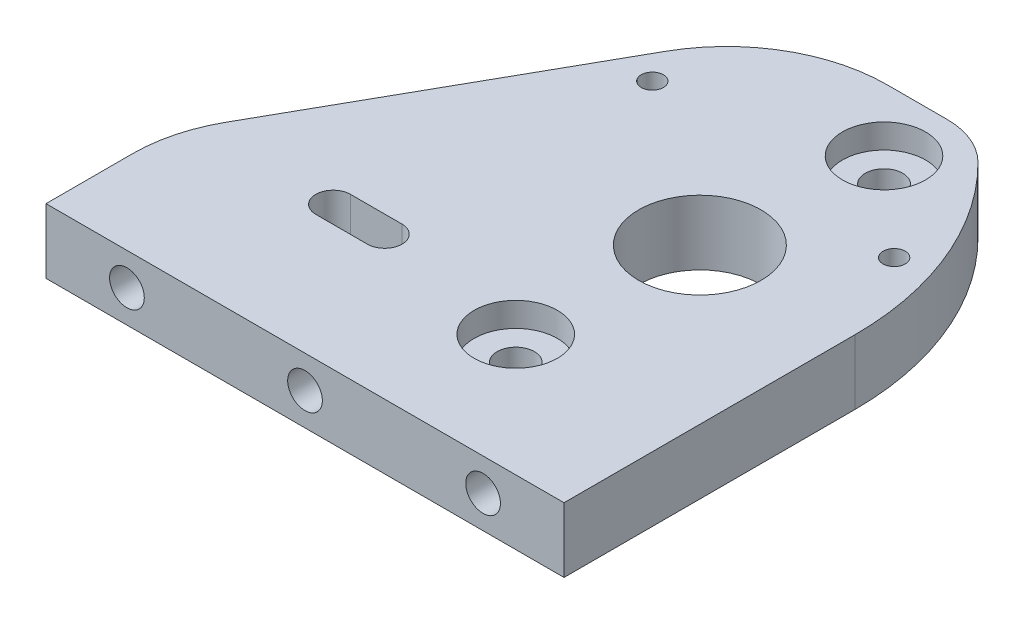
ISO-10303-21;
HEADER;
FILE_DESCRIPTION(('STEP AP214'),'2;1');
FILE_NAME('part.step','',(''),(''),'','','');
FILE_SCHEMA(('AUTOMOTIVE_DESIGN { 1 0 10303 214 1 1 1 1 }'));
ENDSEC;
DATA;
#1=APPLICATION_CONTEXT('core data for automotive mechanical design processes');
#2=APPLICATION_PROTOCOL_DEFINITION('international standard','automotive_design',2000,#1);
#3=PRODUCT_CONTEXT('',#1,'mechanical');
#4=PRODUCT('Part','Part','',(#3));
#5=PRODUCT_RELATED_PRODUCT_CATEGORY('part','',(#4));
#6=PRODUCT_DEFINITION_FORMATION('','',#4);
#7=PRODUCT_DEFINITION_CONTEXT('part definition',#1,'design');
#8=PRODUCT_DEFINITION('design','',#6,#7);
#9=PRODUCT_DEFINITION_SHAPE('','',#8);
#10=(LENGTH_UNIT() NAMED_UNIT(*) SI_UNIT(.MILLI.,.METRE.));
#11=(NAMED_UNIT(*) PLANE_ANGLE_UNIT() SI_UNIT($,.RADIAN.));
#12=(NAMED_UNIT(*) SI_UNIT($,.STERADIAN.) SOLID_ANGLE_UNIT());
#13=UNCERTAINTY_MEASURE_WITH_UNIT(LENGTH_MEASURE(1.E-05),#10,'distance_accuracy_value','');
#14=(GEOMETRIC_REPRESENTATION_CONTEXT(3) GLOBAL_UNCERTAINTY_ASSIGNED_CONTEXT((#13)) GLOBAL_UNIT_ASSIGNED_CONTEXT((#10,
#11,#12)) REPRESENTATION_CONTEXT('',''));
#15=CARTESIAN_POINT('',(0.,0.,0.));
#16=DIRECTION('',(0.,0.,1.));
#17=DIRECTION('',(1.,0.,0.));
#18=AXIS2_PLACEMENT_3D('',#15,#16,#17);
#19=CARTESIAN_POINT('',(0.,9.525,0.));
#20=DIRECTION('',(0.,-1.,0.));
#21=DIRECTION('',(0.,0.,-1.));
#22=AXIS2_PLACEMENT_3D('',#19,#20,#21);
#23=PLANE('',#22);
#24=DIRECTION('',(1.,0.,0.));
#25=VECTOR('',#24,1.);
#26=CARTESIAN_POINT('',(18.030825,9.525,-23.5800563674416));
#27=LINE('',#26,#25);
#28=CARTESIAN_POINT('',(18.030825,9.525,-23.5800563674416));
#29=VERTEX_POINT('',#28);
#30=CARTESIAN_POINT('',(25.625425,9.525,-23.5800563674416));
#31=VERTEX_POINT('',#30);
#32=EDGE_CURVE('E292',#29,#31,#27,.T.);
#33=ORIENTED_EDGE('',*,*,#32,.T.);
#34=CARTESIAN_POINT('',(25.625425,9.525,-21.0273563674416));
#35=DIRECTION('',(0.,1.,0.));
#36=DIRECTION('',(0.,0.,1.));
#37=AXIS2_PLACEMENT_3D('',#34,#35,#36);
#38=CIRCLE('',#37,2.5527);
#39=CARTESIAN_POINT('',(25.625425,9.525,-18.4746563674416));
#40=VERTEX_POINT('',#39);
#41=EDGE_CURVE('E300',#40,#31,#38,.T.);
#42=ORIENTED_EDGE('',*,*,#41,.F.);
#43=DIRECTION('',(1.,0.,0.));
#44=VECTOR('',#43,1.);
#45=CARTESIAN_POINT('',(18.030825,9.525,-18.4746563674416));
#46=LINE('',#45,#44);
#47=CARTESIAN_POINT('',(18.030825,9.525,-18.4746563674416));
#48=VERTEX_POINT('',#47);
#49=EDGE_CURVE('E285',#48,#40,#46,.T.);
#50=ORIENTED_EDGE('',*,*,#49,.F.);
#51=CARTESIAN_POINT('',(18.030825,9.525,-21.0273563674416));
#52=DIRECTION('',(0.,1.,0.));
#53=DIRECTION('',(0.,0.,1.));
#54=AXIS2_PLACEMENT_3D('',#51,#52,#53);
#55=CIRCLE('',#54,2.5527);
#56=EDGE_CURVE('E295',#29,#48,#55,.T.);
#57=ORIENTED_EDGE('',*,*,#56,.F.);
#58=EDGE_LOOP('',(#33,#42,#50,#57));
#59=FACE_BOUND('',#58,.T.);
#60=CARTESIAN_POINT('',(25.8140218113133,9.525,-60.2002575391825));
#61=DIRECTION('',(0.,-1.,0.));
#62=DIRECTION('',(0.,0.,-1.));
#63=AXIS2_PLACEMENT_3D('',#60,#61,#62);
#64=CIRCLE('',#63,1.63195);
#65=CARTESIAN_POINT('',(25.8140218113133,9.525,-61.8322075391825));
#66=VERTEX_POINT('',#65);
#67=EDGE_CURVE('E317',#66,#66,#64,.T.);
#68=ORIENTED_EDGE('',*,*,#67,.T.);
#69=EDGE_LOOP('',(#68));
#70=FACE_BOUND('',#69,.T.);
#71=CARTESIAN_POINT('',(66.0757685720033,9.525,-55.5088169021917));
#72=DIRECTION('',(0.,-1.,0.));
#73=DIRECTION('',(0.,0.,-1.));
#74=AXIS2_PLACEMENT_3D('',#71,#72,#73);
#75=CIRCLE('',#74,1.63194999999999);
#76=CARTESIAN_POINT('',(66.0757685720033,9.525,-57.1407669021917));
#77=VERTEX_POINT('',#76);
#78=EDGE_CURVE('E329',#77,#77,#75,.T.);
#79=ORIENTED_EDGE('',*,*,#78,.T.);
#80=EDGE_LOOP('',(#79));
#81=FACE_BOUND('',#80,.T.);
#82=CARTESIAN_POINT('',(52.3796621440065,9.525,-67.7136843923407));
#83=DIRECTION('',(0.,1.,0.));
#84=DIRECTION('',(0.,0.,1.));
#85=AXIS2_PLACEMENT_3D('',#82,#83,#84);
#86=CIRCLE('',#85,6.11999999999999);
#87=CARTESIAN_POINT('',(52.3796621440065,9.525,-61.5936843923407));
#88=VERTEX_POINT('',#87);
#89=EDGE_CURVE('E332',#88,#88,#86,.T.);
#90=ORIENTED_EDGE('',*,*,#89,.F.);
#91=EDGE_LOOP('',(#90));
#92=FACE_BOUND('',#91,.T.);
#93=CARTESIAN_POINT('',(48.021875,9.525,-17.9039494120426));
#94=DIRECTION('',(0.,1.,0.));
#95=DIRECTION('',(0.,0.,1.));
#96=AXIS2_PLACEMENT_3D('',#93,#94,#95);
#97=CIRCLE('',#96,6.11999999999999);
#98=CARTESIAN_POINT('',(48.021875,9.525,-11.7839494120426));
#99=VERTEX_POINT('',#98);
#100=EDGE_CURVE('E344',#99,#99,#97,.T.);
#101=ORIENTED_EDGE('',*,*,#100,.F.);
#102=EDGE_LOOP('',(#101));
#103=FACE_BOUND('',#102,.T.);
#104=CARTESIAN_POINT('',(50.2007685720033,9.525,-42.8088169021917));
#105=DIRECTION('',(0.,1.,0.));
#106=DIRECTION('',(0.,0.,1.));
#107=AXIS2_PLACEMENT_3D('',#104,#105,#106);
#108=CIRCLE('',#107,8.99999999999999);
#109=CARTESIAN_POINT('',(50.2007685720033,9.525,-33.8088169021917));
#110=VERTEX_POINT('',#109);
#111=EDGE_CURVE('E356',#110,#110,#108,.T.);
#112=ORIENTED_EDGE('',*,*,#111,.F.);
#113=EDGE_LOOP('',(#112));
#114=FACE_BOUND('',#113,.T.);
#115=DIRECTION('',(0.,0.,1.));
#116=VECTOR('',#115,1.);
#117=CARTESIAN_POINT('',(73.025,9.52500000000001,-101.6));
#118=LINE('',#117,#116);
#119=CARTESIAN_POINT('',(73.025,9.52500000000001,-42.7680148106246));
#120=VERTEX_POINT('',#119);
#121=CARTESIAN_POINT('',(73.025,9.52500000000001,0.));
#122=VERTEX_POINT('',#121);
#123=EDGE_CURVE('E283',#120,#122,#118,.T.);
#124=ORIENTED_EDGE('',*,*,#123,.F.);
#125=CARTESIAN_POINT('',(29.2601881915944,9.52500000000001,-42.7680148106246));
#126=DIRECTION('',(0.,1.,0.));
#127=DIRECTION('',(0.,0.,1.));
#128=AXIS2_PLACEMENT_3D('',#125,#126,#127);
#129=CIRCLE('',#128,43.7648118084056);
#130=CARTESIAN_POINT('',(60.0868475316006,9.52500000000001,-73.8336843923407));
#131=VERTEX_POINT('',#130);
#132=EDGE_CURVE('E241',#120,#131,#129,.T.);
#133=ORIENTED_EDGE('',*,*,#132,.T.);
#134=CARTESIAN_POINT('',(52.3796621440065,9.52500000000001,-66.0667424082866));
#135=DIRECTION('',(0.,1.,0.));
#136=DIRECTION('',(0.,0.,1.));
#137=AXIS2_PLACEMENT_3D('',#134,#135,#136);
#138=CIRCLE('',#137,10.9419419840542);
#139=CARTESIAN_POINT('',(52.3796621440065,9.52500000000001,-77.0086843923407));
#140=VERTEX_POINT('',#139);
#141=EDGE_CURVE('E220',#140,#131,#138,.F.);
#142=ORIENTED_EDGE('',*,*,#141,.F.);
#143=DIRECTION('',(-1.,0.,0.));
#144=VECTOR('',#143,1.);
#145=CARTESIAN_POINT('',(1.21517915318178E-13,9.52500000000001,-77.0086843923408));
#146=LINE('',#145,#144);
#147=CARTESIAN_POINT('',(43.5849903578951,9.52500000000001,-77.0086843923407));
#148=VERTEX_POINT('',#147);
#149=EDGE_CURVE('E231',#140,#148,#146,.T.);
#150=ORIENTED_EDGE('',*,*,#149,.T.);
#151=CARTESIAN_POINT('',(43.5849903578951,9.52500000000001,-53.3613331305353));
#152=DIRECTION('',(0.,1.,0.));
#153=DIRECTION('',(0.,0.,1.));
#154=AXIS2_PLACEMENT_3D('',#151,#152,#153);
#155=CIRCLE('',#154,23.6473512618054);
#156=CARTESIAN_POINT('',(22.9795865303334,9.52500000000001,-64.9636843923407));
#157=VERTEX_POINT('',#156);
#158=EDGE_CURVE('E251',#148,#157,#155,.T.);
#159=ORIENTED_EDGE('',*,*,#158,.T.);
#160=DIRECTION('',(-0.490640627500011,0.,0.871362022724422));
#161=VECTOR('',#160,1.);
#162=CARTESIAN_POINT('',(-10.3258873267677,9.52500000000001,-5.8142307162519));
#163=LINE('',#162,#161);
#164=CARTESIAN_POINT('',(-0.322426516871673,9.52500000000001,-23.5800563674416));
#165=VERTEX_POINT('',#164);
#166=EDGE_CURVE('E248',#157,#165,#163,.T.);
#167=ORIENTED_EDGE('',*,*,#166,.T.);
#168=CARTESIAN_POINT('',(19.0002047376904,9.52500000000001,-12.7));
#169=DIRECTION('',(0.,1.,0.));
#170=DIRECTION('',(0.,0.,1.));
#171=AXIS2_PLACEMENT_3D('',#168,#169,#170);
#172=CIRCLE('',#171,22.1752047376904);
#173=CARTESIAN_POINT('',(-3.17499999999998,9.52500000000001,-12.7));
#174=VERTEX_POINT('',#173);
#175=EDGE_CURVE('E243',#165,#174,#172,.T.);
#176=ORIENTED_EDGE('',*,*,#175,.T.);
#177=DIRECTION('',(0.,0.,-1.));
#178=VECTOR('',#177,1.);
#179=CARTESIAN_POINT('',(-3.175,9.52500000000001,-101.6));
#180=LINE('',#179,#178);
#181=CARTESIAN_POINT('',(-3.17499999999998,9.52500000000001,0.));
#182=VERTEX_POINT('',#181);
#183=EDGE_CURVE('E275',#182,#174,#180,.T.);
#184=ORIENTED_EDGE('',*,*,#183,.F.);
#185=DIRECTION('',(1.,0.,0.));
#186=VECTOR('',#185,1.);
#187=CARTESIAN_POINT('',(0.,9.525,0.));
#188=LINE('',#187,#186);
#189=EDGE_CURVE('E381',#182,#122,#188,.T.);
#190=ORIENTED_EDGE('',*,*,#189,.T.);
#191=EDGE_LOOP('',(#124,#133,#142,#150,#159,#167,#176,#184,#190));
#192=FACE_BOUND('',#191,.T.);
#193=ADVANCED_FACE('F113',(#59,#70,#81,#92,#103,#114,#192),#23,.F.);
#194=CARTESIAN_POINT('',(0.,0.,0.));
#195=DIRECTION('',(0.,-1.,0.));
#196=DIRECTION('',(0.,0.,-1.));
#197=AXIS2_PLACEMENT_3D('',#194,#195,#196);
#198=PLANE('',#197);
#199=CARTESIAN_POINT('',(50.2007685720033,0.,-42.8088169021917));
#200=DIRECTION('',(0.,1.,0.));
#201=DIRECTION('',(0.,0.,1.));
#202=AXIS2_PLACEMENT_3D('',#199,#200,#201);
#203=CIRCLE('',#202,9.);
#204=CARTESIAN_POINT('',(50.2007685720033,0.,-33.8088169021917));
#205=VERTEX_POINT('',#204);
#206=EDGE_CURVE('E359',#205,#205,#203,.T.);
#207=ORIENTED_EDGE('',*,*,#206,.T.);
#208=EDGE_LOOP('',(#207));
#209=FACE_BOUND('',#208,.T.);
#210=CARTESIAN_POINT('',(48.021875,0.,-17.9039494120426));
#211=DIRECTION('',(0.,1.,0.));
#212=DIRECTION('',(0.,0.,1.));
#213=AXIS2_PLACEMENT_3D('',#210,#211,#212);
#214=CIRCLE('',#213,2.75);
#215=CARTESIAN_POINT('',(48.021875,0.,-15.1539494120426));
#216=VERTEX_POINT('',#215);
#217=EDGE_CURVE('E353',#216,#216,#214,.T.);
#218=ORIENTED_EDGE('',*,*,#217,.T.);
#219=EDGE_LOOP('',(#218));
#220=FACE_BOUND('',#219,.T.);
#221=CARTESIAN_POINT('',(52.3796621440065,0.,-67.7136843923407));
#222=DIRECTION('',(0.,1.,0.));
#223=DIRECTION('',(0.,0.,1.));
#224=AXIS2_PLACEMENT_3D('',#221,#222,#223);
#225=CIRCLE('',#224,2.75);
#226=CARTESIAN_POINT('',(52.3796621440065,0.,-64.9636843923407));
#227=VERTEX_POINT('',#226);
#228=EDGE_CURVE('E341',#227,#227,#225,.T.);
#229=ORIENTED_EDGE('',*,*,#228,.T.);
#230=EDGE_LOOP('',(#229));
#231=FACE_BOUND('',#230,.T.);
#232=CARTESIAN_POINT('',(66.0757685720033,0.,-55.5088169021917));
#233=DIRECTION('',(0.,-1.,0.));
#234=DIRECTION('',(0.,0.,-1.));
#235=AXIS2_PLACEMENT_3D('',#232,#233,#234);
#236=CIRCLE('',#235,2.77876000000001);
#237=CARTESIAN_POINT('',(66.0757685720033,0.,-58.2875769021917));
#238=VERTEX_POINT('',#237);
#239=EDGE_CURVE('E320',#238,#238,#236,.T.);
#240=ORIENTED_EDGE('',*,*,#239,.F.);
#241=EDGE_LOOP('',(#240));
#242=FACE_BOUND('',#241,.T.);
#243=CARTESIAN_POINT('',(25.8140218113133,0.,-60.2002575391825));
#244=DIRECTION('',(0.,-1.,0.));
#245=DIRECTION('',(0.,0.,-1.));
#246=AXIS2_PLACEMENT_3D('',#243,#244,#245);
#247=CIRCLE('',#246,2.77876);
#248=CARTESIAN_POINT('',(25.8140218113133,0.,-62.9790175391825));
#249=VERTEX_POINT('',#248);
#250=EDGE_CURVE('E308',#249,#249,#247,.T.);
#251=ORIENTED_EDGE('',*,*,#250,.F.);
#252=EDGE_LOOP('',(#251));
#253=FACE_BOUND('',#252,.T.);
#254=DIRECTION('',(-1.,0.,0.));
#255=VECTOR('',#254,1.);
#256=CARTESIAN_POINT('',(0.,0.,-18.4746563674416));
#257=LINE('',#256,#255);
#258=CARTESIAN_POINT('',(25.625425,0.,-18.4746563674416));
#259=VERTEX_POINT('',#258);
#260=CARTESIAN_POINT('',(18.030825,0.,-18.4746563674416));
#261=VERTEX_POINT('',#260);
#262=EDGE_CURVE('E13',#259,#261,#257,.T.);
#263=ORIENTED_EDGE('',*,*,#262,.F.);
#264=CARTESIAN_POINT('',(25.625425,0.,-21.0273563674416));
#265=DIRECTION('',(0.,-1.,0.));
#266=DIRECTION('',(0.,0.,-1.));
#267=AXIS2_PLACEMENT_3D('',#264,#265,#266);
#268=CIRCLE('',#267,2.5527);
#269=CARTESIAN_POINT('',(25.625425,0.,-23.5800563674416));
#270=VERTEX_POINT('',#269);
#271=EDGE_CURVE('E387',#270,#259,#268,.T.);
#272=ORIENTED_EDGE('',*,*,#271,.F.);
#273=DIRECTION('',(1.,0.,0.));
#274=VECTOR('',#273,1.);
#275=CARTESIAN_POINT('',(0.,0.,-23.5800563674416));
#276=LINE('',#275,#274);
#277=CARTESIAN_POINT('',(18.030825,0.,-23.5800563674416));
#278=VERTEX_POINT('',#277);
#279=EDGE_CURVE('E384',#278,#270,#276,.T.);
#280=ORIENTED_EDGE('',*,*,#279,.F.);
#281=CARTESIAN_POINT('',(18.030825,0.,-21.0273563674416));
#282=DIRECTION('',(0.,-1.,0.));
#283=DIRECTION('',(0.,0.,-1.));
#284=AXIS2_PLACEMENT_3D('',#281,#282,#283);
#285=CIRCLE('',#284,2.5527);
#286=EDGE_CURVE('E121',#261,#278,#285,.T.);
#287=ORIENTED_EDGE('',*,*,#286,.F.);
#288=EDGE_LOOP('',(#263,#272,#280,#287));
#289=FACE_BOUND('',#288,.T.);
#290=CARTESIAN_POINT('',(29.2601881915944,0.,-42.7680148106246));
#291=DIRECTION('',(0.,1.,0.));
#292=DIRECTION('',(0.,0.,1.));
#293=AXIS2_PLACEMENT_3D('',#290,#291,#292);
#294=CIRCLE('',#293,43.7648118084056);
#295=CARTESIAN_POINT('',(73.025,0.,-42.7680148106246));
#296=VERTEX_POINT('',#295);
#297=CARTESIAN_POINT('',(60.0868475316006,0.,-73.8336843923407));
#298=VERTEX_POINT('',#297);
#299=EDGE_CURVE('E256',#296,#298,#294,.T.);
#300=ORIENTED_EDGE('',*,*,#299,.F.);
#301=DIRECTION('',(0.,0.,-1.));
#302=VECTOR('',#301,1.);
#303=CARTESIAN_POINT('',(73.025,0.,-101.6));
#304=LINE('',#303,#302);
#305=CARTESIAN_POINT('',(73.025,0.,0.));
#306=VERTEX_POINT('',#305);
#307=EDGE_CURVE('E278',#306,#296,#304,.T.);
#308=ORIENTED_EDGE('',*,*,#307,.F.);
#309=DIRECTION('',(1.,0.,0.));
#310=VECTOR('',#309,1.);
#311=CARTESIAN_POINT('',(0.,0.,0.));
#312=LINE('',#311,#310);
#313=CARTESIAN_POINT('',(-3.17499999999998,0.,0.));
#314=VERTEX_POINT('',#313);
#315=EDGE_CURVE('E380',#314,#306,#312,.T.);
#316=ORIENTED_EDGE('',*,*,#315,.F.);
#317=DIRECTION('',(0.,0.,1.));
#318=VECTOR('',#317,1.);
#319=CARTESIAN_POINT('',(-3.175,0.,-101.6));
#320=LINE('',#319,#318);
#321=CARTESIAN_POINT('',(-3.17499999999999,0.,-12.7));
#322=VERTEX_POINT('',#321);
#323=EDGE_CURVE('E227',#322,#314,#320,.T.);
#324=ORIENTED_EDGE('',*,*,#323,.F.);
#325=CARTESIAN_POINT('',(19.0002047376904,0.,-12.7));
#326=DIRECTION('',(0.,1.,0.));
#327=DIRECTION('',(0.,0.,1.));
#328=AXIS2_PLACEMENT_3D('',#325,#326,#327);
#329=CIRCLE('',#328,22.1752047376904);
#330=CARTESIAN_POINT('',(-0.322426516871673,0.,-23.5800563674416));
#331=VERTEX_POINT('',#330);
#332=EDGE_CURVE('E128',#331,#322,#329,.T.);
#333=ORIENTED_EDGE('',*,*,#332,.F.);
#334=DIRECTION('',(-0.490640627500011,0.,0.871362022724422));
#335=VECTOR('',#334,1.);
#336=CARTESIAN_POINT('',(-10.3258873267677,0.,-5.8142307162519));
#337=LINE('',#336,#335);
#338=CARTESIAN_POINT('',(22.9795865303334,0.,-64.9636843923407));
#339=VERTEX_POINT('',#338);
#340=EDGE_CURVE('E260',#339,#331,#337,.T.);
#341=ORIENTED_EDGE('',*,*,#340,.F.);
#342=CARTESIAN_POINT('',(43.5849903578951,0.,-53.3613331305353));
#343=DIRECTION('',(0.,1.,0.));
#344=DIRECTION('',(0.,0.,1.));
#345=AXIS2_PLACEMENT_3D('',#342,#343,#344);
#346=CIRCLE('',#345,23.6473512618054);
#347=CARTESIAN_POINT('',(43.5849903578951,0.,-77.0086843923407));
#348=VERTEX_POINT('',#347);
#349=EDGE_CURVE('E237',#348,#339,#346,.T.);
#350=ORIENTED_EDGE('',*,*,#349,.F.);
#351=DIRECTION('',(-1.,0.,0.));
#352=VECTOR('',#351,1.);
#353=CARTESIAN_POINT('',(1.21517915318178E-13,0.,-77.0086843923408));
#354=LINE('',#353,#352);
#355=CARTESIAN_POINT('',(52.3796621440065,0.,-77.0086843923407));
#356=VERTEX_POINT('',#355);
#357=EDGE_CURVE('E253',#356,#348,#354,.T.);
#358=ORIENTED_EDGE('',*,*,#357,.F.);
#359=CARTESIAN_POINT('',(52.3796621440065,0.,-66.0667424082866));
#360=DIRECTION('',(0.,1.,0.));
#361=DIRECTION('',(0.,0.,1.));
#362=AXIS2_PLACEMENT_3D('',#359,#360,#361);
#363=CIRCLE('',#362,10.9419419840542);
#364=EDGE_CURVE('E223',#356,#298,#363,.F.);
#365=ORIENTED_EDGE('',*,*,#364,.T.);
#366=EDGE_LOOP('',(#300,#308,#316,#324,#333,#341,#350,#358,#365));
#367=FACE_BOUND('',#366,.T.);
#368=ADVANCED_FACE('F395',(#209,#220,#231,#242,#253,#289,#367),#198,.T.);
#369=CARTESIAN_POINT('',(-3.175,111.174597269246,-101.6));
#370=DIRECTION('',(1.,0.,0.));
#371=DIRECTION('',(0.,0.,-1.));
#372=AXIS2_PLACEMENT_3D('',#369,#370,#371);
#373=PLANE('',#372);
#374=DIRECTION('',(0.,-1.,0.));
#375=VECTOR('',#374,1.);
#376=CARTESIAN_POINT('',(-3.17499999999998,9.52500000000001,-12.7));
#377=LINE('',#376,#375);
#378=EDGE_CURVE('E270',#174,#322,#377,.T.);
#379=ORIENTED_EDGE('',*,*,#378,.T.);
#380=ORIENTED_EDGE('',*,*,#323,.T.);
#381=DIRECTION('',(0.,-1.,0.));
#382=VECTOR('',#381,1.);
#383=CARTESIAN_POINT('',(-3.17499999999998,111.174597269246,0.));
#384=LINE('',#383,#382);
#385=EDGE_CURVE('E279',#182,#314,#384,.T.);
#386=ORIENTED_EDGE('',*,*,#385,.F.);
#387=ORIENTED_EDGE('',*,*,#183,.T.);
#388=EDGE_LOOP('',(#379,#380,#386,#387));
#389=FACE_BOUND('',#388,.T.);
#390=ADVANCED_FACE('F425',(#389),#373,.F.);
#391=CARTESIAN_POINT('',(0.,9.525,0.));
#392=DIRECTION('',(0.,0.,-1.));
#393=DIRECTION('',(-1.,0.,0.));
#394=AXIS2_PLACEMENT_3D('',#391,#392,#393);
#395=PLANE('',#394);
#396=CARTESIAN_POINT('',(8.73125,4.7625,0.));
#397=DIRECTION('',(0.,0.,1.));
#398=DIRECTION('',(1.,0.,0.));
#399=AXIS2_PLACEMENT_3D('',#396,#397,#398);
#400=CIRCLE('',#399,2.5527);
#401=CARTESIAN_POINT('',(11.28395,4.7625,0.));
#402=VERTEX_POINT('',#401);
#403=EDGE_CURVE('E362',#402,#402,#400,.T.);
#404=ORIENTED_EDGE('',*,*,#403,.F.);
#405=EDGE_LOOP('',(#404));
#406=FACE_BOUND('',#405,.T.);
#407=CARTESIAN_POINT('',(61.11875,4.7625,0.));
#408=DIRECTION('',(0.,0.,1.));
#409=DIRECTION('',(1.,0.,0.));
#410=AXIS2_PLACEMENT_3D('',#407,#408,#409);
#411=CIRCLE('',#410,2.55269999999999);
#412=CARTESIAN_POINT('',(63.67145,4.7625,0.));
#413=VERTEX_POINT('',#412);
#414=EDGE_CURVE('E368',#413,#413,#411,.T.);
#415=ORIENTED_EDGE('',*,*,#414,.F.);
#416=EDGE_LOOP('',(#415));
#417=FACE_BOUND('',#416,.T.);
#418=CARTESIAN_POINT('',(34.925,4.7625,0.));
#419=DIRECTION('',(0.,0.,1.));
#420=DIRECTION('',(1.,0.,0.));
#421=AXIS2_PLACEMENT_3D('',#418,#419,#420);
#422=CIRCLE('',#421,2.5527);
#423=CARTESIAN_POINT('',(37.4777,4.7625,0.));
#424=VERTEX_POINT('',#423);
#425=EDGE_CURVE('E374',#424,#424,#422,.T.);
#426=ORIENTED_EDGE('',*,*,#425,.F.);
#427=EDGE_LOOP('',(#426));
#428=FACE_BOUND('',#427,.T.);
#429=ORIENTED_EDGE('',*,*,#315,.T.);
#430=DIRECTION('',(0.,-1.,0.));
#431=VECTOR('',#430,1.);
#432=CARTESIAN_POINT('',(73.025,111.174597269246,0.));
#433=LINE('',#432,#431);
#434=EDGE_CURVE('E286',#122,#306,#433,.T.);
#435=ORIENTED_EDGE('',*,*,#434,.F.);
#436=ORIENTED_EDGE('',*,*,#189,.F.);
#437=ORIENTED_EDGE('',*,*,#385,.T.);
#438=EDGE_LOOP('',(#429,#435,#436,#437));
#439=FACE_BOUND('',#438,.T.);
#440=ADVANCED_FACE('F115',(#406,#417,#428,#439),#395,.F.);
#441=CARTESIAN_POINT('',(34.925,4.7625,-19.05));
#442=DIRECTION('',(0.,0.,1.));
#443=DIRECTION('',(1.,0.,0.));
#444=AXIS2_PLACEMENT_3D('',#441,#442,#443);
#445=CONICAL_SURFACE('',#444,2.5527,1.02974425867665);
#446=CARTESIAN_POINT('',(34.925,4.7625,-20.5838169021917));
#447=VERTEX_POINT('',#446);
#448=VERTEX_LOOP('',#447);
#449=FACE_BOUND('',#448,.T.);
#450=CARTESIAN_POINT('',(34.925,4.7625,-19.05));
#451=DIRECTION('',(0.,0.,1.));
#452=DIRECTION('',(1.,0.,0.));
#453=AXIS2_PLACEMENT_3D('',#450,#451,#452);
#454=CIRCLE('',#453,2.5527);
#455=CARTESIAN_POINT('',(37.4777,4.7625,-19.05));
#456=VERTEX_POINT('',#455);
#457=EDGE_CURVE('E377',#456,#456,#454,.T.);
#458=ORIENTED_EDGE('',*,*,#457,.T.);
#459=EDGE_LOOP('',(#458));
#460=FACE_BOUND('',#459,.T.);
#461=ADVANCED_FACE('F428',(#449,#460),#445,.F.);
#462=CARTESIAN_POINT('',(34.925,4.7625,0.));
#463=DIRECTION('',(0.,0.,1.));
#464=DIRECTION('',(1.,0.,0.));
#465=AXIS2_PLACEMENT_3D('',#462,#463,#464);
#466=CYLINDRICAL_SURFACE('',#465,2.5527);
#467=ORIENTED_EDGE('',*,*,#457,.F.);
#468=EDGE_LOOP('',(#467));
#469=FACE_BOUND('',#468,.T.);
#470=ORIENTED_EDGE('',*,*,#425,.T.);
#471=EDGE_LOOP('',(#470));
#472=FACE_BOUND('',#471,.T.);
#473=ADVANCED_FACE('F431',(#469,#472),#466,.F.);
#474=CARTESIAN_POINT('',(61.11875,4.7625,-19.05));
#475=DIRECTION('',(0.,0.,1.));
#476=DIRECTION('',(1.,0.,0.));
#477=AXIS2_PLACEMENT_3D('',#474,#475,#476);
#478=CONICAL_SURFACE('',#477,2.55269999999999,1.02974425867665);
#479=CARTESIAN_POINT('',(61.11875,4.7625,-20.5838169021917));
#480=VERTEX_POINT('',#479);
#481=VERTEX_LOOP('',#480);
#482=FACE_BOUND('',#481,.T.);
#483=CARTESIAN_POINT('',(61.11875,4.7625,-19.05));
#484=DIRECTION('',(0.,0.,1.));
#485=DIRECTION('',(1.,0.,0.));
#486=AXIS2_PLACEMENT_3D('',#483,#484,#485);
#487=CIRCLE('',#486,2.55269999999999);
#488=CARTESIAN_POINT('',(63.67145,4.7625,-19.05));
#489=VERTEX_POINT('',#488);
#490=EDGE_CURVE('E371',#489,#489,#487,.T.);
#491=ORIENTED_EDGE('',*,*,#490,.T.);
#492=EDGE_LOOP('',(#491));
#493=FACE_BOUND('',#492,.T.);
#494=ADVANCED_FACE('F435',(#482,#493),#478,.F.);
#495=CARTESIAN_POINT('',(61.11875,4.7625,0.));
#496=DIRECTION('',(0.,0.,1.));
#497=DIRECTION('',(1.,0.,0.));
#498=AXIS2_PLACEMENT_3D('',#495,#496,#497);
#499=CYLINDRICAL_SURFACE('',#498,2.55269999999999);
#500=ORIENTED_EDGE('',*,*,#490,.F.);
#501=EDGE_LOOP('',(#500));
#502=FACE_BOUND('',#501,.T.);
#503=ORIENTED_EDGE('',*,*,#414,.T.);
#504=EDGE_LOOP('',(#503));
#505=FACE_BOUND('',#504,.T.);
#506=ADVANCED_FACE('F439',(#502,#505),#499,.F.);
#507=CARTESIAN_POINT('',(8.73125,4.7625,-19.05));
#508=DIRECTION('',(0.,0.,1.));
#509=DIRECTION('',(1.,0.,0.));
#510=AXIS2_PLACEMENT_3D('',#507,#508,#509);
#511=CONICAL_SURFACE('',#510,2.5527,1.02974425867665);
#512=CARTESIAN_POINT('',(8.73124999999999,4.7625,-20.5838169021917));
#513=VERTEX_POINT('',#512);
#514=VERTEX_LOOP('',#513);
#515=FACE_BOUND('',#514,.T.);
#516=CARTESIAN_POINT('',(8.73125,4.7625,-19.05));
#517=DIRECTION('',(0.,0.,1.));
#518=DIRECTION('',(1.,0.,0.));
#519=AXIS2_PLACEMENT_3D('',#516,#517,#518);
#520=CIRCLE('',#519,2.5527);
#521=CARTESIAN_POINT('',(11.28395,4.7625,-19.05));
#522=VERTEX_POINT('',#521);
#523=EDGE_CURVE('E365',#522,#522,#520,.T.);
#524=ORIENTED_EDGE('',*,*,#523,.T.);
#525=EDGE_LOOP('',(#524));
#526=FACE_BOUND('',#525,.T.);
#527=ADVANCED_FACE('F443',(#515,#526),#511,.F.);
#528=CARTESIAN_POINT('',(8.73125,4.7625,0.));
#529=DIRECTION('',(0.,0.,1.));
#530=DIRECTION('',(1.,0.,0.));
#531=AXIS2_PLACEMENT_3D('',#528,#529,#530);
#532=CYLINDRICAL_SURFACE('',#531,2.5527);
#533=ORIENTED_EDGE('',*,*,#523,.F.);
#534=EDGE_LOOP('',(#533));
#535=FACE_BOUND('',#534,.T.);
#536=ORIENTED_EDGE('',*,*,#403,.T.);
#537=EDGE_LOOP('',(#536));
#538=FACE_BOUND('',#537,.T.);
#539=ADVANCED_FACE('F447',(#535,#538),#532,.F.);
#540=CARTESIAN_POINT('',(50.2007685720033,9.525,-42.8088169021917));
#541=DIRECTION('',(0.,1.,0.));
#542=DIRECTION('',(0.,0.,1.));
#543=AXIS2_PLACEMENT_3D('',#540,#541,#542);
#544=CYLINDRICAL_SURFACE('',#543,8.99999999999999);
#545=ORIENTED_EDGE('',*,*,#206,.F.);
#546=EDGE_LOOP('',(#545));
#547=FACE_BOUND('',#546,.T.);
#548=ORIENTED_EDGE('',*,*,#111,.T.);
#549=EDGE_LOOP('',(#548));
#550=FACE_BOUND('',#549,.T.);
#551=ADVANCED_FACE('F451',(#547,#550),#544,.F.);
#552=CARTESIAN_POINT('',(48.021875,9.525,-17.9039494120426));
#553=DIRECTION('',(0.,1.,0.));
#554=DIRECTION('',(0.,0.,1.));
#555=AXIS2_PLACEMENT_3D('',#552,#553,#554);
#556=CYLINDRICAL_SURFACE('',#555,2.75);
#557=ORIENTED_EDGE('',*,*,#217,.F.);
#558=EDGE_LOOP('',(#557));
#559=FACE_BOUND('',#558,.T.);
#560=CARTESIAN_POINT('',(48.021875,5.945,-17.9039494120426));
#561=DIRECTION('',(0.,1.,0.));
#562=DIRECTION('',(0.,0.,1.));
#563=AXIS2_PLACEMENT_3D('',#560,#561,#562);
#564=CIRCLE('',#563,2.75);
#565=CARTESIAN_POINT('',(48.021875,5.945,-15.1539494120426));
#566=VERTEX_POINT('',#565);
#567=EDGE_CURVE('E350',#566,#566,#564,.T.);
#568=ORIENTED_EDGE('',*,*,#567,.T.);
#569=EDGE_LOOP('',(#568));
#570=FACE_BOUND('',#569,.T.);
#571=ADVANCED_FACE('F455',(#559,#570),#556,.F.);
#572=CARTESIAN_POINT('',(50.771875,5.945,-17.9039494120426));
#573=DIRECTION('',(0.,-1.,0.));
#574=DIRECTION('',(0.,0.,-1.));
#575=AXIS2_PLACEMENT_3D('',#572,#573,#574);
#576=PLANE('',#575);
#577=ORIENTED_EDGE('',*,*,#567,.F.);
#578=EDGE_LOOP('',(#577));
#579=FACE_BOUND('',#578,.T.);
#580=CARTESIAN_POINT('',(48.021875,5.945,-17.9039494120426));
#581=DIRECTION('',(0.,1.,0.));
#582=DIRECTION('',(0.,0.,1.));
#583=AXIS2_PLACEMENT_3D('',#580,#581,#582);
#584=CIRCLE('',#583,6.12000000000001);
#585=CARTESIAN_POINT('',(48.021875,5.945,-11.7839494120426));
#586=VERTEX_POINT('',#585);
#587=EDGE_CURVE('E347',#586,#586,#584,.T.);
#588=ORIENTED_EDGE('',*,*,#587,.T.);
#589=EDGE_LOOP('',(#588));
#590=FACE_BOUND('',#589,.T.);
#591=ADVANCED_FACE('F459',(#579,#590),#576,.F.);
#592=CARTESIAN_POINT('',(48.021875,9.525,-17.9039494120426));
#593=DIRECTION('',(0.,1.,0.));
#594=DIRECTION('',(0.,0.,1.));
#595=AXIS2_PLACEMENT_3D('',#592,#593,#594);
#596=CYLINDRICAL_SURFACE('',#595,6.12);
#597=ORIENTED_EDGE('',*,*,#587,.F.);
#598=EDGE_LOOP('',(#597));
#599=FACE_BOUND('',#598,.T.);
#600=ORIENTED_EDGE('',*,*,#100,.T.);
#601=EDGE_LOOP('',(#600));
#602=FACE_BOUND('',#601,.T.);
#603=ADVANCED_FACE('F463',(#599,#602),#596,.F.);
#604=CARTESIAN_POINT('',(52.3796621440065,9.525,-67.7136843923407));
#605=DIRECTION('',(0.,1.,0.));
#606=DIRECTION('',(0.,0.,1.));
#607=AXIS2_PLACEMENT_3D('',#604,#605,#606);
#608=CYLINDRICAL_SURFACE('',#607,2.75);
#609=ORIENTED_EDGE('',*,*,#228,.F.);
#610=EDGE_LOOP('',(#609));
#611=FACE_BOUND('',#610,.T.);
#612=CARTESIAN_POINT('',(52.3796621440065,5.945,-67.7136843923407));
#613=DIRECTION('',(0.,1.,0.));
#614=DIRECTION('',(0.,0.,1.));
#615=AXIS2_PLACEMENT_3D('',#612,#613,#614);
#616=CIRCLE('',#615,2.75);
#617=CARTESIAN_POINT('',(52.3796621440065,5.945,-64.9636843923407));
#618=VERTEX_POINT('',#617);
#619=EDGE_CURVE('E338',#618,#618,#616,.T.);
#620=ORIENTED_EDGE('',*,*,#619,.T.);
#621=EDGE_LOOP('',(#620));
#622=FACE_BOUND('',#621,.T.);
#623=ADVANCED_FACE('F467',(#611,#622),#608,.F.);
#624=CARTESIAN_POINT('',(55.1296621440065,5.945,-67.7136843923407));
#625=DIRECTION('',(0.,-1.,0.));
#626=DIRECTION('',(0.,0.,-1.));
#627=AXIS2_PLACEMENT_3D('',#624,#625,#626);
#628=PLANE('',#627);
#629=ORIENTED_EDGE('',*,*,#619,.F.);
#630=EDGE_LOOP('',(#629));
#631=FACE_BOUND('',#630,.T.);
#632=CARTESIAN_POINT('',(52.3796621440065,5.945,-67.7136843923407));
#633=DIRECTION('',(0.,1.,0.));
#634=DIRECTION('',(0.,0.,1.));
#635=AXIS2_PLACEMENT_3D('',#632,#633,#634);
#636=CIRCLE('',#635,6.12000000000001);
#637=CARTESIAN_POINT('',(52.3796621440065,5.945,-61.5936843923407));
#638=VERTEX_POINT('',#637);
#639=EDGE_CURVE('E335',#638,#638,#636,.T.);
#640=ORIENTED_EDGE('',*,*,#639,.T.);
#641=EDGE_LOOP('',(#640));
#642=FACE_BOUND('',#641,.T.);
#643=ADVANCED_FACE('F471',(#631,#642),#628,.F.);
#644=CARTESIAN_POINT('',(52.3796621440065,9.525,-67.7136843923407));
#645=DIRECTION('',(0.,1.,0.));
#646=DIRECTION('',(0.,0.,1.));
#647=AXIS2_PLACEMENT_3D('',#644,#645,#646);
#648=CYLINDRICAL_SURFACE('',#647,6.12);
#649=ORIENTED_EDGE('',*,*,#639,.F.);
#650=EDGE_LOOP('',(#649));
#651=FACE_BOUND('',#650,.T.);
#652=ORIENTED_EDGE('',*,*,#89,.T.);
#653=EDGE_LOOP('',(#652));
#654=FACE_BOUND('',#653,.T.);
#655=ADVANCED_FACE('F475',(#651,#654),#648,.F.);
#656=CARTESIAN_POINT('',(66.0757685720033,0.,-55.5088169021917));
#657=DIRECTION('',(0.,-1.,0.));
#658=DIRECTION('',(0.,0.,-1.));
#659=AXIS2_PLACEMENT_3D('',#656,#657,#658);
#660=CYLINDRICAL_SURFACE('',#659,1.63195);
#661=ORIENTED_EDGE('',*,*,#78,.F.);
#662=EDGE_LOOP('',(#661));
#663=FACE_BOUND('',#662,.T.);
#664=CARTESIAN_POINT('',(66.0757685720033,2.8448,-55.5088169021917));
#665=DIRECTION('',(0.,-1.,0.));
#666=DIRECTION('',(0.,0.,-1.));
#667=AXIS2_PLACEMENT_3D('',#664,#665,#666);
#668=CIRCLE('',#667,1.63195000000001);
#669=CARTESIAN_POINT('',(66.0757685720033,2.8448,-57.1407669021917));
#670=VERTEX_POINT('',#669);
#671=EDGE_CURVE('E326',#670,#670,#668,.T.);
#672=ORIENTED_EDGE('',*,*,#671,.T.);
#673=EDGE_LOOP('',(#672));
#674=FACE_BOUND('',#673,.T.);
#675=ADVANCED_FACE('F479',(#663,#674),#660,.F.);
#676=CARTESIAN_POINT('',(67.7077185720033,2.8448,-55.5088169021917));
#677=DIRECTION('',(0.,1.,0.));
#678=DIRECTION('',(0.,0.,1.));
#679=AXIS2_PLACEMENT_3D('',#676,#677,#678);
#680=PLANE('',#679);
#681=ORIENTED_EDGE('',*,*,#671,.F.);
#682=EDGE_LOOP('',(#681));
#683=FACE_BOUND('',#682,.T.);
#684=CARTESIAN_POINT('',(66.0757685720033,2.8448,-55.5088169021917));
#685=DIRECTION('',(0.,-1.,0.));
#686=DIRECTION('',(0.,0.,-1.));
#687=AXIS2_PLACEMENT_3D('',#684,#685,#686);
#688=CIRCLE('',#687,2.77876000000001);
#689=CARTESIAN_POINT('',(66.0757685720033,2.8448,-58.2875769021917));
#690=VERTEX_POINT('',#689);
#691=EDGE_CURVE('E323',#690,#690,#688,.T.);
#692=ORIENTED_EDGE('',*,*,#691,.T.);
#693=EDGE_LOOP('',(#692));
#694=FACE_BOUND('',#693,.T.);
#695=ADVANCED_FACE('F483',(#683,#694),#680,.F.);
#696=CARTESIAN_POINT('',(66.0757685720033,0.,-55.5088169021917));
#697=DIRECTION('',(0.,-1.,0.));
#698=DIRECTION('',(0.,0.,-1.));
#699=AXIS2_PLACEMENT_3D('',#696,#697,#698);
#700=CYLINDRICAL_SURFACE('',#699,2.77876000000001);
#701=ORIENTED_EDGE('',*,*,#691,.F.);
#702=EDGE_LOOP('',(#701));
#703=FACE_BOUND('',#702,.T.);
#704=ORIENTED_EDGE('',*,*,#239,.T.);
#705=EDGE_LOOP('',(#704));
#706=FACE_BOUND('',#705,.T.);
#707=ADVANCED_FACE('F487',(#703,#706),#700,.F.);
#708=CARTESIAN_POINT('',(25.8140218113133,0.,-60.2002575391825));
#709=DIRECTION('',(0.,-1.,0.));
#710=DIRECTION('',(0.,0.,-1.));
#711=AXIS2_PLACEMENT_3D('',#708,#709,#710);
#712=CYLINDRICAL_SURFACE('',#711,1.63195);
#713=ORIENTED_EDGE('',*,*,#67,.F.);
#714=EDGE_LOOP('',(#713));
#715=FACE_BOUND('',#714,.T.);
#716=CARTESIAN_POINT('',(25.8140218113133,2.8448,-60.2002575391825));
#717=DIRECTION('',(0.,-1.,0.));
#718=DIRECTION('',(0.,0.,-1.));
#719=AXIS2_PLACEMENT_3D('',#716,#717,#718);
#720=CIRCLE('',#719,1.63195);
#721=CARTESIAN_POINT('',(25.8140218113133,2.8448,-61.8322075391825));
#722=VERTEX_POINT('',#721);
#723=EDGE_CURVE('E314',#722,#722,#720,.T.);
#724=ORIENTED_EDGE('',*,*,#723,.T.);
#725=EDGE_LOOP('',(#724));
#726=FACE_BOUND('',#725,.T.);
#727=ADVANCED_FACE('F491',(#715,#726),#712,.F.);
#728=CARTESIAN_POINT('',(27.4459718113133,2.8448,-60.2002575391825));
#729=DIRECTION('',(0.,1.,0.));
#730=DIRECTION('',(0.,0.,1.));
#731=AXIS2_PLACEMENT_3D('',#728,#729,#730);
#732=PLANE('',#731);
#733=ORIENTED_EDGE('',*,*,#723,.F.);
#734=EDGE_LOOP('',(#733));
#735=FACE_BOUND('',#734,.T.);
#736=CARTESIAN_POINT('',(25.8140218113133,2.8448,-60.2002575391825));
#737=DIRECTION('',(0.,-1.,0.));
#738=DIRECTION('',(0.,0.,-1.));
#739=AXIS2_PLACEMENT_3D('',#736,#737,#738);
#740=CIRCLE('',#739,2.77876);
#741=CARTESIAN_POINT('',(25.8140218113133,2.8448,-62.9790175391825));
#742=VERTEX_POINT('',#741);
#743=EDGE_CURVE('E311',#742,#742,#740,.T.);
#744=ORIENTED_EDGE('',*,*,#743,.T.);
#745=EDGE_LOOP('',(#744));
#746=FACE_BOUND('',#745,.T.);
#747=ADVANCED_FACE('F495',(#735,#746),#732,.F.);
#748=CARTESIAN_POINT('',(25.8140218113133,0.,-60.2002575391825));
#749=DIRECTION('',(0.,-1.,0.));
#750=DIRECTION('',(0.,0.,-1.));
#751=AXIS2_PLACEMENT_3D('',#748,#749,#750);
#752=CYLINDRICAL_SURFACE('',#751,2.77876);
#753=ORIENTED_EDGE('',*,*,#743,.F.);
#754=EDGE_LOOP('',(#753));
#755=FACE_BOUND('',#754,.T.);
#756=ORIENTED_EDGE('',*,*,#250,.T.);
#757=EDGE_LOOP('',(#756));
#758=FACE_BOUND('',#757,.T.);
#759=ADVANCED_FACE('F499',(#755,#758),#752,.F.);
#760=CARTESIAN_POINT('',(25.625425,9.525,-21.0273563674416));
#761=DIRECTION('',(0.,1.,0.));
#762=DIRECTION('',(0.,0.,1.));
#763=AXIS2_PLACEMENT_3D('',#760,#761,#762);
#764=CYLINDRICAL_SURFACE('',#763,2.5527);
#765=ORIENTED_EDGE('',*,*,#271,.T.);
#766=DIRECTION('',(0.,1.,0.));
#767=VECTOR('',#766,1.);
#768=CARTESIAN_POINT('',(25.625425,9.525,-18.4746563674416));
#769=LINE('',#768,#767);
#770=EDGE_CURVE('E305',#40,#259,#769,.F.);
#771=ORIENTED_EDGE('',*,*,#770,.F.);
#772=ORIENTED_EDGE('',*,*,#41,.T.);
#773=DIRECTION('',(0.,1.,0.));
#774=VECTOR('',#773,1.);
#775=CARTESIAN_POINT('',(25.625425,9.525,-23.5800563674416));
#776=LINE('',#775,#774);
#777=EDGE_CURVE('E303',#270,#31,#776,.T.);
#778=ORIENTED_EDGE('',*,*,#777,.F.);
#779=EDGE_LOOP('',(#765,#771,#772,#778));
#780=FACE_BOUND('',#779,.T.);
#781=ADVANCED_FACE('F401',(#780),#764,.F.);
#782=CARTESIAN_POINT('',(18.030825,9.525,-21.0273563674416));
#783=DIRECTION('',(0.,1.,0.));
#784=DIRECTION('',(0.,0.,1.));
#785=AXIS2_PLACEMENT_3D('',#782,#783,#784);
#786=CYLINDRICAL_SURFACE('',#785,2.5527);
#787=ORIENTED_EDGE('',*,*,#286,.T.);
#788=DIRECTION('',(0.,1.,0.));
#789=VECTOR('',#788,1.);
#790=CARTESIAN_POINT('',(18.030825,9.525,-23.5800563674416));
#791=LINE('',#790,#789);
#792=EDGE_CURVE('E136',#29,#278,#791,.F.);
#793=ORIENTED_EDGE('',*,*,#792,.F.);
#794=ORIENTED_EDGE('',*,*,#56,.T.);
#795=DIRECTION('',(0.,1.,0.));
#796=VECTOR('',#795,1.);
#797=CARTESIAN_POINT('',(18.030825,9.525,-18.4746563674416));
#798=LINE('',#797,#796);
#799=EDGE_CURVE('E297',#261,#48,#798,.T.);
#800=ORIENTED_EDGE('',*,*,#799,.F.);
#801=EDGE_LOOP('',(#787,#793,#794,#800));
#802=FACE_BOUND('',#801,.T.);
#803=ADVANCED_FACE('F391',(#802),#786,.F.);
#804=CARTESIAN_POINT('',(18.030825,9.525,-23.5800563674416));
#805=DIRECTION('',(0.,0.,-1.));
#806=DIRECTION('',(-1.,0.,0.));
#807=AXIS2_PLACEMENT_3D('',#804,#805,#806);
#808=PLANE('',#807);
#809=ORIENTED_EDGE('',*,*,#279,.T.);
#810=ORIENTED_EDGE('',*,*,#777,.T.);
#811=ORIENTED_EDGE('',*,*,#32,.F.);
#812=ORIENTED_EDGE('',*,*,#792,.T.);
#813=EDGE_LOOP('',(#809,#810,#811,#812));
#814=FACE_BOUND('',#813,.T.);
#815=ADVANCED_FACE('F399',(#814),#808,.F.);
#816=CARTESIAN_POINT('',(18.030825,9.525,-18.4746563674416));
#817=DIRECTION('',(0.,0.,1.));
#818=DIRECTION('',(1.,0.,0.));
#819=AXIS2_PLACEMENT_3D('',#816,#817,#818);
#820=PLANE('',#819);
#821=ORIENTED_EDGE('',*,*,#262,.T.);
#822=ORIENTED_EDGE('',*,*,#799,.T.);
#823=ORIENTED_EDGE('',*,*,#49,.T.);
#824=ORIENTED_EDGE('',*,*,#770,.T.);
#825=EDGE_LOOP('',(#821,#822,#823,#824));
#826=FACE_BOUND('',#825,.T.);
#827=ADVANCED_FACE('F409',(#826),#820,.F.);
#828=CARTESIAN_POINT('',(73.025,111.174597269246,-101.6));
#829=DIRECTION('',(-1.,0.,0.));
#830=DIRECTION('',(0.,0.,1.));
#831=AXIS2_PLACEMENT_3D('',#828,#829,#830);
#832=PLANE('',#831);
#833=ORIENTED_EDGE('',*,*,#307,.T.);
#834=DIRECTION('',(0.,-1.,0.));
#835=VECTOR('',#834,1.);
#836=CARTESIAN_POINT('',(73.025,9.52500000000001,-42.7680148106246));
#837=LINE('',#836,#835);
#838=EDGE_CURVE('E272',#120,#296,#837,.T.);
#839=ORIENTED_EDGE('',*,*,#838,.F.);
#840=ORIENTED_EDGE('',*,*,#123,.T.);
#841=ORIENTED_EDGE('',*,*,#434,.T.);
#842=EDGE_LOOP('',(#833,#839,#840,#841));
#843=FACE_BOUND('',#842,.T.);
#844=ADVANCED_FACE('F411',(#843),#832,.F.);
#845=CARTESIAN_POINT('',(1.21517915318178E-13,9.52500000000001,-77.0086843923408));
#846=DIRECTION('',(0.,0.,1.));
#847=DIRECTION('',(1.,0.,0.));
#848=AXIS2_PLACEMENT_3D('',#845,#846,#847);
#849=PLANE('',#848);
#850=ORIENTED_EDGE('',*,*,#357,.T.);
#851=DIRECTION('',(0.,-1.,0.));
#852=VECTOR('',#851,1.);
#853=CARTESIAN_POINT('',(43.5849903578951,9.52500000000001,-77.0086843923407));
#854=LINE('',#853,#852);
#855=EDGE_CURVE('E233',#148,#348,#854,.T.);
#856=ORIENTED_EDGE('',*,*,#855,.F.);
#857=ORIENTED_EDGE('',*,*,#149,.F.);
#858=DIRECTION('',(0.,-1.,0.));
#859=VECTOR('',#858,1.);
#860=CARTESIAN_POINT('',(52.3796621440065,9.52500000000001,-77.0086843923407));
#861=LINE('',#860,#859);
#862=EDGE_CURVE('E216',#140,#356,#861,.T.);
#863=ORIENTED_EDGE('',*,*,#862,.T.);
#864=EDGE_LOOP('',(#850,#856,#857,#863));
#865=FACE_BOUND('',#864,.T.);
#866=ADVANCED_FACE('F232',(#865),#849,.F.);
#867=CARTESIAN_POINT('',(52.3796621440065,9.52500000000001,-66.0667424082866));
#868=DIRECTION('',(0.,-1.,0.));
#869=DIRECTION('',(0.,0.,-1.));
#870=AXIS2_PLACEMENT_3D('',#867,#868,#869);
#871=CYLINDRICAL_SURFACE('',#870,10.9419419840542);
#872=ORIENTED_EDGE('',*,*,#364,.F.);
#873=ORIENTED_EDGE('',*,*,#862,.F.);
#874=ORIENTED_EDGE('',*,*,#141,.T.);
#875=DIRECTION('',(0.,-1.,0.));
#876=VECTOR('',#875,1.);
#877=CARTESIAN_POINT('',(60.0868475316006,9.52500000000001,-73.8336843923407));
#878=LINE('',#877,#876);
#879=EDGE_CURVE('E228',#131,#298,#878,.T.);
#880=ORIENTED_EDGE('',*,*,#879,.T.);
#881=EDGE_LOOP('',(#872,#873,#874,#880));
#882=FACE_BOUND('',#881,.T.);
#883=ADVANCED_FACE('F218',(#882),#871,.T.);
#884=CARTESIAN_POINT('',(29.2601881915944,9.52500000000001,-42.7680148106246));
#885=DIRECTION('',(0.,-1.,0.));
#886=DIRECTION('',(0.,0.,-1.));
#887=AXIS2_PLACEMENT_3D('',#884,#885,#886);
#888=CYLINDRICAL_SURFACE('',#887,43.7648118084056);
#889=ORIENTED_EDGE('',*,*,#299,.T.);
#890=ORIENTED_EDGE('',*,*,#879,.F.);
#891=ORIENTED_EDGE('',*,*,#132,.F.);
#892=ORIENTED_EDGE('',*,*,#838,.T.);
#893=EDGE_LOOP('',(#889,#890,#891,#892));
#894=FACE_BOUND('',#893,.T.);
#895=ADVANCED_FACE('F577',(#894),#888,.T.);
#896=CARTESIAN_POINT('',(19.0002047376904,9.52500000000001,-12.7));
#897=DIRECTION('',(0.,-1.,0.));
#898=DIRECTION('',(0.,0.,-1.));
#899=AXIS2_PLACEMENT_3D('',#896,#897,#898);
#900=CYLINDRICAL_SURFACE('',#899,22.1752047376904);
#901=ORIENTED_EDGE('',*,*,#332,.T.);
#902=ORIENTED_EDGE('',*,*,#378,.F.);
#903=ORIENTED_EDGE('',*,*,#175,.F.);
#904=DIRECTION('',(0.,-1.,0.));
#905=VECTOR('',#904,1.);
#906=CARTESIAN_POINT('',(-0.322426516871673,9.52500000000001,-23.5800563674416));
#907=LINE('',#906,#905);
#908=EDGE_CURVE('E268',#165,#331,#907,.T.);
#909=ORIENTED_EDGE('',*,*,#908,.T.);
#910=EDGE_LOOP('',(#901,#902,#903,#909));
#911=FACE_BOUND('',#910,.T.);
#912=ADVANCED_FACE('F586',(#911),#900,.T.);
#913=CARTESIAN_POINT('',(-10.3258873267677,9.52500000000001,-5.8142307162519));
#914=DIRECTION('',(0.871362022724422,0.,0.490640627500011));
#915=DIRECTION('',(0.490640627500011,0.,-0.871362022724422));
#916=AXIS2_PLACEMENT_3D('',#913,#914,#915);
#917=PLANE('',#916);
#918=ORIENTED_EDGE('',*,*,#340,.T.);
#919=ORIENTED_EDGE('',*,*,#908,.F.);
#920=ORIENTED_EDGE('',*,*,#166,.F.);
#921=DIRECTION('',(0.,-1.,0.));
#922=VECTOR('',#921,1.);
#923=CARTESIAN_POINT('',(22.9795865303334,9.52500000000001,-64.9636843923407));
#924=LINE('',#923,#922);
#925=EDGE_CURVE('E266',#157,#339,#924,.T.);
#926=ORIENTED_EDGE('',*,*,#925,.T.);
#927=EDGE_LOOP('',(#918,#919,#920,#926));
#928=FACE_BOUND('',#927,.T.);
#929=ADVANCED_FACE('F596',(#928),#917,.F.);
#930=CARTESIAN_POINT('',(43.5849903578951,9.52500000000001,-53.3613331305353));
#931=DIRECTION('',(0.,-1.,0.));
#932=DIRECTION('',(0.,0.,-1.));
#933=AXIS2_PLACEMENT_3D('',#930,#931,#932);
#934=CYLINDRICAL_SURFACE('',#933,23.6473512618054);
#935=ORIENTED_EDGE('',*,*,#349,.T.);
#936=ORIENTED_EDGE('',*,*,#925,.F.);
#937=ORIENTED_EDGE('',*,*,#158,.F.);
#938=ORIENTED_EDGE('',*,*,#855,.T.);
#939=EDGE_LOOP('',(#935,#936,#937,#938));
#940=FACE_BOUND('',#939,.T.);
#941=ADVANCED_FACE('F605',(#940),#934,.T.);
#942=CLOSED_SHELL('',(#193,#368,#390,#440,#461,#473,#494,#506,#527,#539,#551,#571,#591,#603,
#623,#643,#655,#675,#695,#707,#727,#747,#759,#781,#803,#815,#827,#844,#866,#883,#895,#912,#929,#941));
#943=MANIFOLD_SOLID_BREP('B2',#942);
#944=ADVANCED_BREP_SHAPE_REPRESENTATION('',(#18,#943),#14);
#945=SHAPE_DEFINITION_REPRESENTATION(#9,#944);
ENDSEC;
END-ISO-10303-21;
